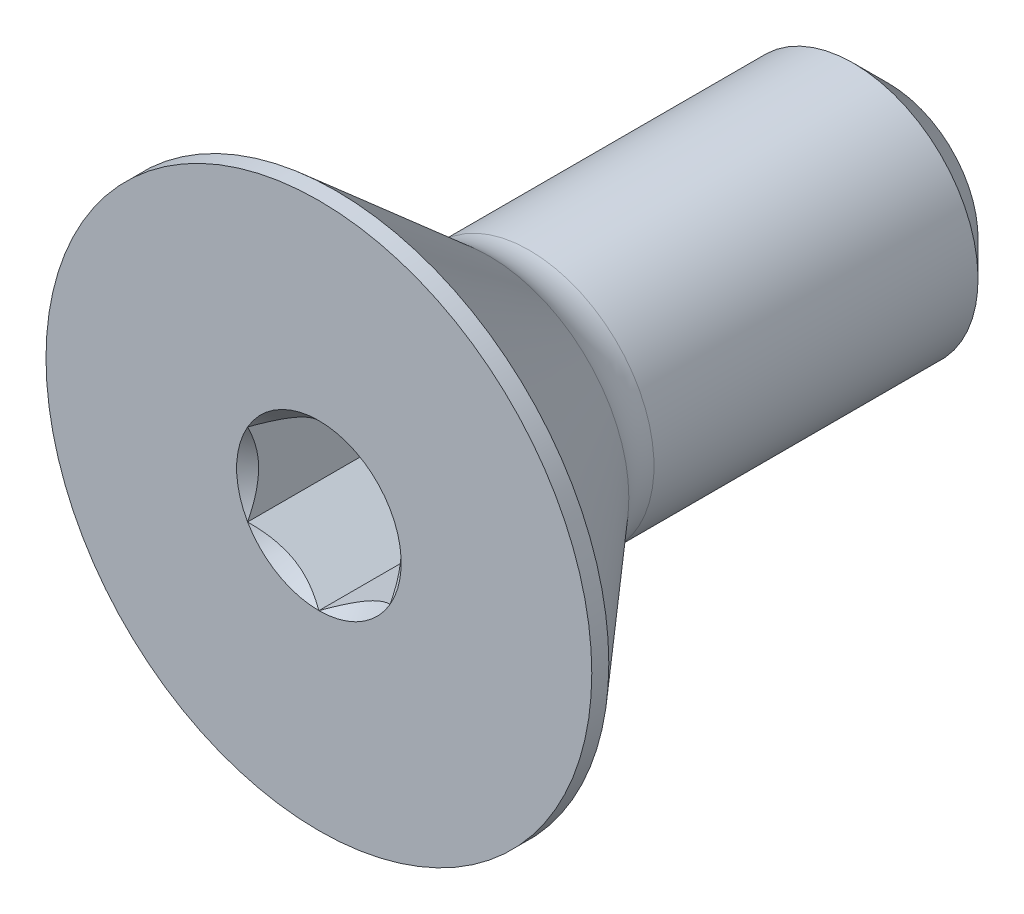
ISO-10303-21;
HEADER;
FILE_DESCRIPTION(('STEP AP214'),'2;1');
FILE_NAME('part.step','',(''),(''),'','','');
FILE_SCHEMA(('AUTOMOTIVE_DESIGN { 1 0 10303 214 1 1 1 1 }'));
ENDSEC;
DATA;
#1=APPLICATION_CONTEXT('core data for automotive mechanical design processes');
#2=APPLICATION_PROTOCOL_DEFINITION('international standard','automotive_design',2000,#1);
#3=PRODUCT_CONTEXT('',#1,'mechanical');
#4=PRODUCT('Part','Part','',(#3));
#5=PRODUCT_RELATED_PRODUCT_CATEGORY('part','',(#4));
#6=PRODUCT_DEFINITION_FORMATION('','',#4);
#7=PRODUCT_DEFINITION_CONTEXT('part definition',#1,'design');
#8=PRODUCT_DEFINITION('design','',#6,#7);
#9=PRODUCT_DEFINITION_SHAPE('','',#8);
#10=(LENGTH_UNIT() NAMED_UNIT(*) SI_UNIT(.MILLI.,.METRE.));
#11=(NAMED_UNIT(*) PLANE_ANGLE_UNIT() SI_UNIT($,.RADIAN.));
#12=(NAMED_UNIT(*) SI_UNIT($,.STERADIAN.) SOLID_ANGLE_UNIT());
#13=UNCERTAINTY_MEASURE_WITH_UNIT(LENGTH_MEASURE(1.E-05),#10,'distance_accuracy_value','');
#14=(GEOMETRIC_REPRESENTATION_CONTEXT(3) GLOBAL_UNCERTAINTY_ASSIGNED_CONTEXT((#13)) GLOBAL_UNIT_ASSIGNED_CONTEXT((#10,
#11,#12)) REPRESENTATION_CONTEXT('',''));
#15=CARTESIAN_POINT('',(0.,0.,0.));
#16=DIRECTION('',(0.,0.,1.));
#17=DIRECTION('',(1.,0.,0.));
#18=AXIS2_PLACEMENT_3D('',#15,#16,#17);
#19=CARTESIAN_POINT('',(0.,0.,-9.525));
#20=DIRECTION('',(0.,0.,-1.));
#21=DIRECTION('',(0.,1.,0.));
#22=AXIS2_PLACEMENT_3D('',#19,#20,#21);
#23=CYLINDRICAL_SURFACE('',#22,2.0828);
#24=CARTESIAN_POINT('',(0.,0.,-8.92968749999999));
#25=DIRECTION('',(0.,0.,-1.));
#26=DIRECTION('',(0.,1.,0.));
#27=AXIS2_PLACEMENT_3D('',#24,#25,#26);
#28=CIRCLE('',#27,2.0828);
#29=CARTESIAN_POINT('',(0.,2.0828,-8.92968749999999));
#30=VERTEX_POINT('',#29);
#31=EDGE_CURVE('E48',#30,#30,#28,.F.);
#32=ORIENTED_EDGE('',*,*,#31,.T.);
#33=EDGE_LOOP('',(#32));
#34=FACE_BOUND('',#33,.T.);
#35=CARTESIAN_POINT('',(0.,0.,-3.5157228625789));
#36=DIRECTION('',(0.,0.,1.));
#37=DIRECTION('',(0.,-1.,0.));
#38=AXIS2_PLACEMENT_3D('',#35,#36,#37);
#39=CIRCLE('',#38,2.08280000000001);
#40=CARTESIAN_POINT('',(0.,-2.08280000000001,-3.5157228625789));
#41=VERTEX_POINT('',#40);
#42=EDGE_CURVE('E175',#41,#41,#39,.T.);
#43=ORIENTED_EDGE('',*,*,#42,.F.);
#44=EDGE_LOOP('',(#43));
#45=FACE_BOUND('',#44,.T.);
#46=ADVANCED_FACE('F35',(#34,#45),#23,.T.);
#47=CARTESIAN_POINT('',(0.,-2.0828,-9.525));
#48=DIRECTION('',(0.,0.,-1.));
#49=DIRECTION('',(0.,1.,0.));
#50=AXIS2_PLACEMENT_3D('',#47,#48,#49);
#51=PLANE('',#50);
#52=CARTESIAN_POINT('',(0.,0.,-9.525));
#53=DIRECTION('',(0.,0.,-1.));
#54=DIRECTION('',(0.,1.,0.));
#55=AXIS2_PLACEMENT_3D('',#52,#53,#54);
#56=CIRCLE('',#55,1.4874875);
#57=CARTESIAN_POINT('',(0.,1.48748749999999,-9.525));
#58=VERTEX_POINT('',#57);
#59=EDGE_CURVE('E178',#58,#58,#56,.T.);
#60=ORIENTED_EDGE('',*,*,#59,.T.);
#61=EDGE_LOOP('',(#60));
#62=FACE_BOUND('',#61,.T.);
#63=ADVANCED_FACE('F188',(#62),#51,.T.);
#64=CARTESIAN_POINT('',(0.,0.,-9.525));
#65=DIRECTION('',(0.,0.,1.));
#66=DIRECTION('',(0.,-1.,0.));
#67=AXIS2_PLACEMENT_3D('',#64,#65,#66);
#68=CONICAL_SURFACE('',#67,1.4874875,0.785398163397446);
#69=ORIENTED_EDGE('',*,*,#31,.F.);
#70=EDGE_LOOP('',(#69));
#71=FACE_BOUND('',#70,.T.);
#72=ORIENTED_EDGE('',*,*,#59,.F.);
#73=EDGE_LOOP('',(#72));
#74=FACE_BOUND('',#73,.T.);
#75=ADVANCED_FACE('F37',(#71,#74),#68,.T.);
#76=CARTESIAN_POINT('',(0.,0.,-3.5157228625789));
#77=DIRECTION('',(0.,0.,1.));
#78=DIRECTION('',(0.,-1.,0.));
#79=AXIS2_PLACEMENT_3D('',#76,#77,#78);
#80=TOROIDAL_SURFACE('',#79,3.1054562442274,1.02265624422739);
#81=CARTESIAN_POINT('',(0.,0.,-2.8448));
#82=DIRECTION('',(0.,0.,1.));
#83=DIRECTION('',(0.,-1.,0.));
#84=AXIS2_PLACEMENT_3D('',#81,#82,#83);
#85=CIRCLE('',#84,2.33364777943435);
#86=CARTESIAN_POINT('',(0.,-2.33364777943435,-2.8448));
#87=VERTEX_POINT('',#86);
#88=EDGE_CURVE('E172',#87,#87,#85,.T.);
#89=ORIENTED_EDGE('',*,*,#88,.F.);
#90=EDGE_LOOP('',(#89));
#91=FACE_BOUND('',#90,.T.);
#92=ORIENTED_EDGE('',*,*,#42,.T.);
#93=EDGE_LOOP('',(#92));
#94=FACE_BOUND('',#93,.T.);
#95=ADVANCED_FACE('F187',(#91,#94),#80,.F.);
#96=CARTESIAN_POINT('',(0.,0.,-2.8448));
#97=DIRECTION('',(0.,0.,1.));
#98=DIRECTION('',(0.,-1.,0.));
#99=AXIS2_PLACEMENT_3D('',#96,#97,#98);
#100=CONICAL_SURFACE('',#99,2.33364777943435,0.715584993317676);
#101=CARTESIAN_POINT('',(0.,0.,-0.284479999999997));
#102=DIRECTION('',(0.,0.,1.));
#103=DIRECTION('',(0.,-1.,0.));
#104=AXIS2_PLACEMENT_3D('',#101,#102,#103);
#105=CIRCLE('',#104,4.5593);
#106=CARTESIAN_POINT('',(0.,-4.5593,-0.284479999999994));
#107=VERTEX_POINT('',#106);
#108=EDGE_CURVE('E169',#107,#107,#105,.T.);
#109=ORIENTED_EDGE('',*,*,#108,.F.);
#110=EDGE_LOOP('',(#109));
#111=FACE_BOUND('',#110,.T.);
#112=ORIENTED_EDGE('',*,*,#88,.T.);
#113=EDGE_LOOP('',(#112));
#114=FACE_BOUND('',#113,.T.);
#115=ADVANCED_FACE('F202',(#111,#114),#100,.T.);
#116=CARTESIAN_POINT('',(0.,0.,0.));
#117=DIRECTION('',(0.,0.,1.));
#118=DIRECTION('',(0.,-1.,0.));
#119=AXIS2_PLACEMENT_3D('',#116,#117,#118);
#120=CYLINDRICAL_SURFACE('',#119,4.5593);
#121=CARTESIAN_POINT('',(0.,0.,0.));
#122=DIRECTION('',(0.,0.,1.));
#123=DIRECTION('',(0.,-1.,0.));
#124=AXIS2_PLACEMENT_3D('',#121,#122,#123);
#125=CIRCLE('',#124,4.5593);
#126=CARTESIAN_POINT('',(0.,-4.5593,0.));
#127=VERTEX_POINT('',#126);
#128=EDGE_CURVE('E166',#127,#127,#125,.T.);
#129=ORIENTED_EDGE('',*,*,#128,.F.);
#130=EDGE_LOOP('',(#129));
#131=FACE_BOUND('',#130,.T.);
#132=ORIENTED_EDGE('',*,*,#108,.T.);
#133=EDGE_LOOP('',(#132));
#134=FACE_BOUND('',#133,.T.);
#135=ADVANCED_FACE('F198',(#131,#134),#120,.T.);
#136=CARTESIAN_POINT('',(0.,-2.08280000000001,0.));
#137=DIRECTION('',(0.,0.,1.));
#138=DIRECTION('',(0.,-1.,0.));
#139=AXIS2_PLACEMENT_3D('',#136,#137,#138);
#140=PLANE('',#139);
#141=CARTESIAN_POINT('',(0.,0.,0.));
#142=DIRECTION('',(0.,0.,1.));
#143=DIRECTION('',(1.,0.,0.));
#144=AXIS2_PLACEMENT_3D('',#141,#142,#143);
#145=CIRCLE('',#144,1.3748153285078);
#146=CARTESIAN_POINT('',(0.,-1.3748153285078,0.));
#147=VERTEX_POINT('',#146);
#148=CARTESIAN_POINT('',(1.190625,-0.687407664253901,0.));
#149=VERTEX_POINT('',#148);
#150=EDGE_CURVE('E94',#147,#149,#145,.T.);
#151=ORIENTED_EDGE('',*,*,#150,.F.);
#152=CARTESIAN_POINT('',(-1.190625,-0.687407664253898,0.));
#153=VERTEX_POINT('',#152);
#154=EDGE_CURVE('E54',#153,#147,#145,.T.);
#155=ORIENTED_EDGE('',*,*,#154,.F.);
#156=CARTESIAN_POINT('',(-1.190625,0.6874076642539,0.));
#157=VERTEX_POINT('',#156);
#158=EDGE_CURVE('E136',#157,#153,#145,.T.);
#159=ORIENTED_EDGE('',*,*,#158,.F.);
#160=CARTESIAN_POINT('',(0.,1.3748153285078,0.));
#161=VERTEX_POINT('',#160);
#162=EDGE_CURVE('E61',#161,#157,#145,.T.);
#163=ORIENTED_EDGE('',*,*,#162,.F.);
#164=CARTESIAN_POINT('',(1.190625,0.6874076642539,0.));
#165=VERTEX_POINT('',#164);
#166=EDGE_CURVE('E130',#165,#161,#145,.T.);
#167=ORIENTED_EDGE('',*,*,#166,.F.);
#168=EDGE_CURVE('E102',#149,#165,#145,.T.);
#169=ORIENTED_EDGE('',*,*,#168,.F.);
#170=EDGE_LOOP('',(#151,#155,#159,#163,#167,#169));
#171=FACE_BOUND('',#170,.T.);
#172=ORIENTED_EDGE('',*,*,#128,.T.);
#173=EDGE_LOOP('',(#172));
#174=FACE_BOUND('',#173,.T.);
#175=ADVANCED_FACE('F128',(#171,#174),#140,.T.);
#176=CARTESIAN_POINT('',(0.,0.,0.));
#177=DIRECTION('',(0.,0.,1.));
#178=DIRECTION('',(1.,0.,0.));
#179=AXIS2_PLACEMENT_3D('',#176,#177,#178);
#180=CONICAL_SURFACE('',#179,1.3748153285078,0.78539816339745);
#181=ORIENTED_EDGE('',*,*,#168,.T.);
#182=CARTESIAN_POINT('',(1.190625,-1.37097145294693,0.44099044728994));
#183=CARTESIAN_POINT('',(1.190625,-1.3375892063789,0.415789988807825));
#184=CARTESIAN_POINT('',(1.190625,-1.30402095496658,0.390836620237449));
#185=CARTESIAN_POINT('',(1.190625,-1.23643692297761,0.341526087177203));
#186=CARTESIAN_POINT('',(1.190625,-1.20242103219112,0.317169073899368));
#187=CARTESIAN_POINT('',(1.190625,-1.09909081482554,0.244798208989213));
#188=CARTESIAN_POINT('',(1.190625,-1.02900143506767,0.197872622595561));
#189=CARTESIAN_POINT('',(1.190625,-0.882026737424228,0.105752103325632));
#190=CARTESIAN_POINT('',(1.190625,-0.80498186601998,0.0608088372420599));
#191=CARTESIAN_POINT('',(1.190625,-0.647043893307964,-0.0214019754931322));
#192=CARTESIAN_POINT('',(1.190625,-0.56616494370292,-0.0586953982678785));
#193=CARTESIAN_POINT('',(1.190625,-0.444764933868856,-0.104320444436903));
#194=CARTESIAN_POINT('',(1.190625,-0.406041211486713,-0.117415160978516));
#195=CARTESIAN_POINT('',(1.190625,-0.327658904711933,-0.140495724103359));
#196=CARTESIAN_POINT('',(1.190625,-0.288000256118252,-0.150481356514043));
#197=CARTESIAN_POINT('',(1.190625,-0.208647693212097,-0.166658770934748));
#198=CARTESIAN_POINT('',(1.190625,-0.168967240621961,-0.172915554151022));
#199=CARTESIAN_POINT('',(1.190625,-0.0891819742965333,-0.181513111581486));
#200=CARTESIAN_POINT('',(1.190625,-0.0490772347013124,-0.183854558950103));
#201=CARTESIAN_POINT('',(1.190625,0.0297075773931764,-0.184447755932347));
#202=CARTESIAN_POINT('',(1.190625,0.0683866068288086,-0.182844646203951));
#203=CARTESIAN_POINT('',(1.190625,0.14541687663315,-0.175956972255489));
#204=CARTESIAN_POINT('',(1.190625,0.183768052740678,-0.170671702331516));
#205=CARTESIAN_POINT('',(1.190625,0.260508634904943,-0.156618587767133));
#206=CARTESIAN_POINT('',(1.190625,0.298887052039132,-0.147791637394191));
#207=CARTESIAN_POINT('',(1.190625,0.374805334250663,-0.127124290019378));
#208=CARTESIAN_POINT('',(1.190625,0.412345269207093,-0.115284145164062));
#209=CARTESIAN_POINT('',(1.190625,0.530535580908838,-0.0735526663328075));
#210=CARTESIAN_POINT('',(1.190625,0.609503725744446,-0.0389086030856534));
#211=CARTESIAN_POINT('',(1.190625,0.763730269113465,0.0381182519748624));
#212=CARTESIAN_POINT('',(1.190625,0.838974064674604,0.0805288466686649));
#213=CARTESIAN_POINT('',(1.190625,0.982775796189616,0.168025645024958));
#214=CARTESIAN_POINT('',(1.190625,1.05148016607044,0.212874162055225));
#215=CARTESIAN_POINT('',(1.190625,1.15270222256253,0.282205329922605));
#216=CARTESIAN_POINT('',(1.190625,1.18600604145834,0.305560176337172));
#217=CARTESIAN_POINT('',(1.190625,1.25215860362231,0.352887569019308));
#218=CARTESIAN_POINT('',(1.190625,1.28500746868278,0.376859944858281));
#219=CARTESIAN_POINT('',(1.190625,1.31766689427973,0.401088366771254));
#220=B_SPLINE_CURVE_WITH_KNOTS('',3,(#182,#183,#184,#185,#186,#187,#188,#189,#190,#191,#192,
#193,#194,#195,#196,#197,#198,#199,#200,#201,#202,#203,#204,#205,#206,#207,#208,#209,#210,#211,
#212,#213,#214,#215,#216,#217,#218,#219),.UNSPECIFIED.,.F.,.F.,(4,2,2,2,2,2,2,2,2,2,2,2,2,2,2,2,
2,2,4),(0.,0.125475644763329,0.250982782413967,0.503912518769173,0.771279184643224,
1.03772598255657,1.16025581644629,1.28279408906665,1.40312855503246,1.5234423300503,
1.63939577664876,1.75537145240477,1.87336894094838,1.99135655861152,2.24929724983448,
2.50818004711563,2.75419821472196,2.87622362118596,2.99821570388961),.UNSPECIFIED.);
#221=EDGE_CURVE('E11',#149,#165,#220,.T.);
#222=ORIENTED_EDGE('',*,*,#221,.F.);
#223=EDGE_LOOP('',(#181,#222));
#224=FACE_BOUND('',#223,.T.);
#225=ADVANCED_FACE('F106',(#224),#180,.F.);
#226=ORIENTED_EDGE('',*,*,#166,.T.);
#227=CARTESIAN_POINT('',(1.190825,0.687292194200061,0.000115484600023907));
#228=CARTESIAN_POINT('',(1.14989058041014,0.710925692369386,-0.0235012357857367));
#229=CARTESIAN_POINT('',(1.10827161169803,0.734954415158721,-0.0457312182768792));
#230=CARTESIAN_POINT('',(1.02340555632637,0.78395185507261,-0.0864343373725629));
#231=CARTESIAN_POINT('',(0.980150392709039,0.808925235430916,-0.104884817352448));
#232=CARTESIAN_POINT('',(0.892928352542576,0.859282903800292,-0.136491161995679));
#233=CARTESIAN_POINT('',(0.848983705042075,0.884654357864149,-0.149726495756683));
#234=CARTESIAN_POINT('',(0.760126625836307,0.935956016463003,-0.170118548424605));
#235=CARTESIAN_POINT('',(0.715216911165245,0.96188465231757,-0.177290497104007));
#236=CARTESIAN_POINT('',(0.637820872343022,1.00656927616579,-0.183761461351143));
#237=CARTESIAN_POINT('',(0.605434587484354,1.025267506447,-0.18471967985321));
#238=CARTESIAN_POINT('',(0.540718926682231,1.06263111063189,-0.183107350927916));
#239=CARTESIAN_POINT('',(0.508389564872728,1.08129647637533,-0.180536024820421));
#240=CARTESIAN_POINT('',(0.444042843928516,1.11844707303394,-0.172013246006379));
#241=CARTESIAN_POINT('',(0.412025803663232,1.13693211984976,-0.166058645247436));
#242=CARTESIAN_POINT('',(0.348526236603543,1.17359361198509,-0.1510900359288));
#243=CARTESIAN_POINT('',(0.317043945355836,1.19176992131166,-0.142074714087946));
#244=CARTESIAN_POINT('',(0.236410161427874,1.23832385816825,-0.115317704161983));
#245=CARTESIAN_POINT('',(0.187767164732342,1.26640790540461,-0.0955631855639916));
#246=CARTESIAN_POINT('',(0.0923855836478815,1.32147648691945,-0.0510632310423198));
#247=CARTESIAN_POINT('',(0.0456413824128448,1.34846426408555,-0.0263340352838412));
#248=CARTESIAN_POINT('',(-0.000199999999999753,1.37493079856163,0.000115484600024262));
#249=B_SPLINE_CURVE_WITH_KNOTS('',3,(#227,#228,#229,#230,#231,#232,#233,#234,#235,#236,#237,
#238,#239,#240,#241,#242,#243,#244,#245,#246,#247,#248),.UNSPECIFIED.,.F.,.F.,(4,2,2,2,2,2,2,2,
2,2,4),(0.,0.15862567293412,0.318176079843271,0.475191357500655,0.631811068630748,
0.743878551794717,0.855970763007028,0.968167444423241,1.08041232768376,1.25873351645467,
1.43648174479847),.UNSPECIFIED.);
#250=EDGE_CURVE('E132',#165,#161,#249,.T.);
#251=ORIENTED_EDGE('',*,*,#250,.F.);
#252=EDGE_LOOP('',(#226,#251));
#253=FACE_BOUND('',#252,.T.);
#254=ADVANCED_FACE('F278',(#253),#180,.F.);
#255=ORIENTED_EDGE('',*,*,#162,.T.);
#256=CARTESIAN_POINT('',(0.000200000000000185,1.37493079856163,0.000115484600024211));
#257=CARTESIAN_POINT('',(-0.040734419589856,1.35129730039231,-0.0235012357857364));
#258=CARTESIAN_POINT('',(-0.0823533883019736,1.32726857760297,-0.045731218276879));
#259=CARTESIAN_POINT('',(-0.167219443673632,1.27827113768909,-0.0864343373725627));
#260=CARTESIAN_POINT('',(-0.21047460729096,1.25329775733078,-0.104884817352448));
#261=CARTESIAN_POINT('',(-0.297696647457424,1.2029400889614,-0.136491161995679));
#262=CARTESIAN_POINT('',(-0.341641294957925,1.17756863489755,-0.149726495756683));
#263=CARTESIAN_POINT('',(-0.430498374163693,1.12626697629869,-0.170118548424605));
#264=CARTESIAN_POINT('',(-0.475408088834755,1.10033834044413,-0.177290497104008));
#265=CARTESIAN_POINT('',(-0.552804127656978,1.0556537165959,-0.183761461351144));
#266=CARTESIAN_POINT('',(-0.585190412515646,1.0369554863147,-0.18471967985321));
#267=CARTESIAN_POINT('',(-0.64990607331777,0.99959188212981,-0.183107350927916));
#268=CARTESIAN_POINT('',(-0.682235435127273,0.980926516386365,-0.180536024820421));
#269=CARTESIAN_POINT('',(-0.746582156071485,0.943775919727754,-0.172013246006379));
#270=CARTESIAN_POINT('',(-0.778599196336768,0.925290872911938,-0.166058645247436));
#271=CARTESIAN_POINT('',(-0.842098763396457,0.888629380776601,-0.1510900359288));
#272=CARTESIAN_POINT('',(-0.873581054644164,0.870453071450031,-0.142074714087946));
#273=CARTESIAN_POINT('',(-0.954214838572127,0.823899134593444,-0.115317704161983));
#274=CARTESIAN_POINT('',(-1.00285783526766,0.795815087357089,-0.0955631855639917));
#275=CARTESIAN_POINT('',(-1.09823941635212,0.740746505842244,-0.0510632310423198));
#276=CARTESIAN_POINT('',(-1.14498361758716,0.713758728676141,-0.026334035283841));
#277=CARTESIAN_POINT('',(-1.190825,0.687292194200061,0.000115484600024368));
#278=B_SPLINE_CURVE_WITH_KNOTS('',3,(#256,#257,#258,#259,#260,#261,#262,#263,#264,#265,#266,
#267,#268,#269,#270,#271,#272,#273,#274,#275,#276,#277),.UNSPECIFIED.,.F.,.F.,(4,2,2,2,2,2,2,2,
2,2,4),(0.,0.15862567293412,0.318176079843271,0.475191357500655,0.631811068630748,
0.743878551794718,0.855970763007029,0.968167444423242,1.08041232768377,1.25873351645467,
1.43648174479847),.UNSPECIFIED.);
#279=EDGE_CURVE('E135',#161,#157,#278,.T.);
#280=ORIENTED_EDGE('',*,*,#279,.F.);
#281=EDGE_LOOP('',(#255,#280));
#282=FACE_BOUND('',#281,.T.);
#283=ADVANCED_FACE('F274',(#282),#180,.F.);
#284=ORIENTED_EDGE('',*,*,#158,.T.);
#285=CARTESIAN_POINT('',(-1.190625,-1.37097145294693,0.44099044728994));
#286=CARTESIAN_POINT('',(-1.190625,-1.3375892063789,0.415789988807825));
#287=CARTESIAN_POINT('',(-1.190625,-1.30402095496658,0.390836620237449));
#288=CARTESIAN_POINT('',(-1.190625,-1.23643692297761,0.341526087177203));
#289=CARTESIAN_POINT('',(-1.190625,-1.20242103219112,0.317169073899368));
#290=CARTESIAN_POINT('',(-1.190625,-1.09909081482554,0.244798208989213));
#291=CARTESIAN_POINT('',(-1.190625,-1.02900143506767,0.197872622595561));
#292=CARTESIAN_POINT('',(-1.190625,-0.882026737424227,0.105752103325632));
#293=CARTESIAN_POINT('',(-1.190625,-0.804981866019979,0.0608088372420601));
#294=CARTESIAN_POINT('',(-1.190625,-0.647043893307963,-0.021401975493132));
#295=CARTESIAN_POINT('',(-1.190625,-0.566164943702919,-0.0586953982678783));
#296=CARTESIAN_POINT('',(-1.190625,-0.444764933868855,-0.104320444436902));
#297=CARTESIAN_POINT('',(-1.190625,-0.406041211486712,-0.117415160978515));
#298=CARTESIAN_POINT('',(-1.190625,-0.327658904711932,-0.140495724103359));
#299=CARTESIAN_POINT('',(-1.190625,-0.288000256118251,-0.150481356514043));
#300=CARTESIAN_POINT('',(-1.190625,-0.208647693212096,-0.166658770934748));
#301=CARTESIAN_POINT('',(-1.190625,-0.168967240621961,-0.172915554151022));
#302=CARTESIAN_POINT('',(-1.190625,-0.0891819742965325,-0.181513111581485));
#303=CARTESIAN_POINT('',(-1.190625,-0.0490772347013118,-0.183854558950103));
#304=CARTESIAN_POINT('',(-1.190625,0.0297075773931769,-0.184447755932347));
#305=CARTESIAN_POINT('',(-1.190625,0.068386606828809,-0.182844646203951));
#306=CARTESIAN_POINT('',(-1.190625,0.145416876633151,-0.175956972255488));
#307=CARTESIAN_POINT('',(-1.190625,0.183768052740679,-0.170671702331516));
#308=CARTESIAN_POINT('',(-1.190625,0.260508634904944,-0.156618587767133));
#309=CARTESIAN_POINT('',(-1.190625,0.298887052039132,-0.14779163739419));
#310=CARTESIAN_POINT('',(-1.190625,0.374805334250663,-0.127124290019377));
#311=CARTESIAN_POINT('',(-1.190625,0.412345269207094,-0.115284145164061));
#312=CARTESIAN_POINT('',(-1.190625,0.530535580908839,-0.0735526663328067));
#313=CARTESIAN_POINT('',(-1.190625,0.609503725744447,-0.0389086030856525));
#314=CARTESIAN_POINT('',(-1.190625,0.763730269113466,0.0381182519748635));
#315=CARTESIAN_POINT('',(-1.190625,0.838974064674605,0.080528846668666));
#316=CARTESIAN_POINT('',(-1.190625,0.982775796189618,0.168025645024959));
#317=CARTESIAN_POINT('',(-1.190625,1.05148016607044,0.212874162055226));
#318=CARTESIAN_POINT('',(-1.190625,1.15270222256253,0.282205329922607));
#319=CARTESIAN_POINT('',(-1.190625,1.18600604145834,0.305560176337173));
#320=CARTESIAN_POINT('',(-1.190625,1.25215860362232,0.35288756901931));
#321=CARTESIAN_POINT('',(-1.190625,1.28500746868279,0.376859944858282));
#322=CARTESIAN_POINT('',(-1.190625,1.31766689427973,0.401088366771256));
#323=B_SPLINE_CURVE_WITH_KNOTS('',3,(#285,#286,#287,#288,#289,#290,#291,#292,#293,#294,#295,
#296,#297,#298,#299,#300,#301,#302,#303,#304,#305,#306,#307,#308,#309,#310,#311,#312,#313,#314,
#315,#316,#317,#318,#319,#320,#321,#322),.UNSPECIFIED.,.F.,.F.,(4,2,2,2,2,2,2,2,2,2,2,2,2,2,2,2,
2,2,4),(0.,0.125475644763329,0.250982782413966,0.503912518769173,0.771279184643224,
1.03772598255657,1.16025581644629,1.28279408906665,1.40312855503246,1.5234423300503,
1.63939577664876,1.75537145240477,1.87336894094838,1.99135655861152,2.24929724983449,
2.50818004711563,2.75419821472196,2.87622362118596,2.99821570388961),.UNSPECIFIED.);
#324=EDGE_CURVE('E142',#157,#153,#323,.F.);
#325=ORIENTED_EDGE('',*,*,#324,.F.);
#326=EDGE_LOOP('',(#284,#325));
#327=FACE_BOUND('',#326,.T.);
#328=ADVANCED_FACE('F140',(#327),#180,.F.);
#329=ORIENTED_EDGE('',*,*,#154,.T.);
#330=CARTESIAN_POINT('',(-1.190825,-0.68729219420006,0.000115484600023689));
#331=CARTESIAN_POINT('',(-1.14989058041014,-0.710925692369384,-0.0235012357857369));
#332=CARTESIAN_POINT('',(-1.10827161169803,-0.73495441515872,-0.0457312182768796));
#333=CARTESIAN_POINT('',(-1.02340555632637,-0.783951855072609,-0.0864343373725634));
#334=CARTESIAN_POINT('',(-0.98015039270904,-0.808925235430915,-0.104884817352449));
#335=CARTESIAN_POINT('',(-0.892928352542576,-0.859282903800291,-0.13649116199568));
#336=CARTESIAN_POINT('',(-0.848983705042075,-0.884654357864148,-0.149726495756684));
#337=CARTESIAN_POINT('',(-0.760126625836306,-0.935956016463002,-0.170118548424606));
#338=CARTESIAN_POINT('',(-0.715216911165245,-0.961884652317569,-0.177290497104008));
#339=CARTESIAN_POINT('',(-0.637820872343022,-1.00656927616579,-0.183761461351144));
#340=CARTESIAN_POINT('',(-0.605434587484354,-1.02526750644699,-0.184719679853211));
#341=CARTESIAN_POINT('',(-0.540718926682231,-1.06263111063188,-0.183107350927917));
#342=CARTESIAN_POINT('',(-0.508389564872728,-1.08129647637533,-0.180536024820421));
#343=CARTESIAN_POINT('',(-0.444042843928516,-1.11844707303394,-0.172013246006379));
#344=CARTESIAN_POINT('',(-0.412025803663232,-1.13693211984976,-0.166058645247437));
#345=CARTESIAN_POINT('',(-0.348526236603543,-1.17359361198509,-0.151090035928801));
#346=CARTESIAN_POINT('',(-0.317043945355836,-1.19176992131166,-0.142074714087946));
#347=CARTESIAN_POINT('',(-0.236410161427874,-1.23832385816825,-0.115317704161984));
#348=CARTESIAN_POINT('',(-0.187767164732342,-1.26640790540461,-0.0955631855639923));
#349=CARTESIAN_POINT('',(-0.0923855836478813,-1.32147648691945,-0.0510632310423205));
#350=CARTESIAN_POINT('',(-0.0456413824128447,-1.34846426408555,-0.0263340352838419));
#351=CARTESIAN_POINT('',(0.000199999999999914,-1.37493079856163,0.000115484600023635));
#352=B_SPLINE_CURVE_WITH_KNOTS('',3,(#330,#331,#332,#333,#334,#335,#336,#337,#338,#339,#340,
#341,#342,#343,#344,#345,#346,#347,#348,#349,#350,#351),.UNSPECIFIED.,.F.,.F.,(4,2,2,2,2,2,2,2,
2,2,4),(0.,0.15862567293412,0.318176079843271,0.475191357500656,0.631811068630749,
0.743878551794718,0.855970763007029,0.968167444423242,1.08041232768377,1.25873351645467,
1.43648174479847),.UNSPECIFIED.);
#353=EDGE_CURVE('E118',#153,#147,#352,.T.);
#354=ORIENTED_EDGE('',*,*,#353,.F.);
#355=EDGE_LOOP('',(#329,#354));
#356=FACE_BOUND('',#355,.T.);
#357=ADVANCED_FACE('F229',(#356),#180,.F.);
#358=ORIENTED_EDGE('',*,*,#150,.T.);
#359=CARTESIAN_POINT('',(-0.000200000000000002,-1.37493079856163,0.00011548460002356));
#360=CARTESIAN_POINT('',(0.0407344195898563,-1.35129730039231,-0.0235012357857371));
#361=CARTESIAN_POINT('',(0.0823533883019738,-1.32726857760297,-0.0457312182768796));
#362=CARTESIAN_POINT('',(0.167219443673632,-1.27827113768909,-0.0864343373725633));
#363=CARTESIAN_POINT('',(0.21047460729096,-1.25329775733078,-0.104884817352449));
#364=CARTESIAN_POINT('',(0.297696647457424,-1.2029400889614,-0.136491161995679));
#365=CARTESIAN_POINT('',(0.341641294957925,-1.17756863489755,-0.149726495756684));
#366=CARTESIAN_POINT('',(0.430498374163693,-1.12626697629869,-0.170118548424606));
#367=CARTESIAN_POINT('',(0.475408088834754,-1.10033834044413,-0.177290497104008));
#368=CARTESIAN_POINT('',(0.552804127656978,-1.0556537165959,-0.183761461351144));
#369=CARTESIAN_POINT('',(0.585190412515646,-1.0369554863147,-0.184719679853211));
#370=CARTESIAN_POINT('',(0.64990607331777,-0.99959188212981,-0.183107350927916));
#371=CARTESIAN_POINT('',(0.682235435127272,-0.980926516386364,-0.180536024820421));
#372=CARTESIAN_POINT('',(0.746582156071484,-0.943775919727754,-0.172013246006379));
#373=CARTESIAN_POINT('',(0.778599196336768,-0.925290872911937,-0.166058645247436));
#374=CARTESIAN_POINT('',(0.842098763396457,-0.888629380776601,-0.1510900359288));
#375=CARTESIAN_POINT('',(0.873581054644164,-0.870453071450031,-0.142074714087946));
#376=CARTESIAN_POINT('',(0.954214838572126,-0.823899134593444,-0.115317704161984));
#377=CARTESIAN_POINT('',(1.00285783526766,-0.795815087357089,-0.0955631855639921));
#378=CARTESIAN_POINT('',(1.09823941635212,-0.740746505842244,-0.0510632310423204));
#379=CARTESIAN_POINT('',(1.14498361758715,-0.713758728676141,-0.0263340352838418));
#380=CARTESIAN_POINT('',(1.190825,-0.687292194200061,0.000115484600023613));
#381=B_SPLINE_CURVE_WITH_KNOTS('',3,(#359,#360,#361,#362,#363,#364,#365,#366,#367,#368,#369,
#370,#371,#372,#373,#374,#375,#376,#377,#378,#379,#380),.UNSPECIFIED.,.F.,.F.,(4,2,2,2,2,2,2,2,
2,2,4),(0.,0.15862567293412,0.318176079843271,0.475191357500655,0.631811068630748,
0.743878551794718,0.855970763007028,0.968167444423241,1.08041232768377,1.25873351645467,
1.43648174479847),.UNSPECIFIED.);
#382=EDGE_CURVE('E98',#147,#149,#381,.T.);
#383=ORIENTED_EDGE('',*,*,#382,.F.);
#384=EDGE_LOOP('',(#358,#383));
#385=FACE_BOUND('',#384,.T.);
#386=ADVANCED_FACE('F96',(#385),#180,.F.);
#387=CARTESIAN_POINT('',(1.190625,-0.687407664253899,-1.99136));
#388=DIRECTION('',(0.,0.,1.));
#389=DIRECTION('',(1.,0.,0.));
#390=AXIS2_PLACEMENT_3D('',#387,#388,#389);
#391=PLANE('',#390);
#392=DIRECTION('',(0.866025403784439,0.5,0.));
#393=VECTOR('',#392,1.);
#394=CARTESIAN_POINT('',(0.,-1.3748153285078,-1.99136));
#395=LINE('',#394,#393);
#396=CARTESIAN_POINT('',(0.,-1.3748153285078,-1.99136));
#397=VERTEX_POINT('',#396);
#398=CARTESIAN_POINT('',(1.190625,-0.687407664253899,-1.99136));
#399=VERTEX_POINT('',#398);
#400=EDGE_CURVE('E117',#397,#399,#395,.T.);
#401=ORIENTED_EDGE('',*,*,#400,.T.);
#402=DIRECTION('',(0.,1.,0.));
#403=VECTOR('',#402,1.);
#404=CARTESIAN_POINT('',(1.190625,-0.687407664253899,-1.99136));
#405=LINE('',#404,#403);
#406=CARTESIAN_POINT('',(1.190625,0.687407664253899,-1.99136));
#407=VERTEX_POINT('',#406);
#408=EDGE_CURVE('E122',#399,#407,#405,.T.);
#409=ORIENTED_EDGE('',*,*,#408,.T.);
#410=DIRECTION('',(-0.866025403784439,0.5,0.));
#411=VECTOR('',#410,1.);
#412=CARTESIAN_POINT('',(1.190625,0.687407664253899,-1.99136));
#413=LINE('',#412,#411);
#414=CARTESIAN_POINT('',(0.,1.3748153285078,-1.99136));
#415=VERTEX_POINT('',#414);
#416=EDGE_CURVE('E260',#407,#415,#413,.T.);
#417=ORIENTED_EDGE('',*,*,#416,.T.);
#418=DIRECTION('',(-0.866025403784439,-0.5,0.));
#419=VECTOR('',#418,1.);
#420=CARTESIAN_POINT('',(0.,1.3748153285078,-1.99136));
#421=LINE('',#420,#419);
#422=CARTESIAN_POINT('',(-1.190625,0.687407664253899,-1.99136));
#423=VERTEX_POINT('',#422);
#424=EDGE_CURVE('E262',#415,#423,#421,.T.);
#425=ORIENTED_EDGE('',*,*,#424,.T.);
#426=DIRECTION('',(0.,-1.,0.));
#427=VECTOR('',#426,1.);
#428=CARTESIAN_POINT('',(-1.190625,0.687407664253899,-1.99136));
#429=LINE('',#428,#427);
#430=CARTESIAN_POINT('',(-1.190625,-0.687407664253898,-1.99136));
#431=VERTEX_POINT('',#430);
#432=EDGE_CURVE('E157',#423,#431,#429,.T.);
#433=ORIENTED_EDGE('',*,*,#432,.T.);
#434=DIRECTION('',(0.866025403784439,-0.5,0.));
#435=VECTOR('',#434,1.);
#436=CARTESIAN_POINT('',(-1.190625,-0.687407664253898,-1.99136));
#437=LINE('',#436,#435);
#438=EDGE_CURVE('E125',#431,#397,#437,.T.);
#439=ORIENTED_EDGE('',*,*,#438,.T.);
#440=EDGE_LOOP('',(#401,#409,#417,#425,#433,#439));
#441=FACE_BOUND('',#440,.T.);
#442=ADVANCED_FACE('F228',(#441),#391,.T.);
#443=CARTESIAN_POINT('',(1.190625,-0.687407664253899,-1.99136));
#444=DIRECTION('',(1.,0.,0.));
#445=DIRECTION('',(0.,1.,0.));
#446=AXIS2_PLACEMENT_3D('',#443,#444,#445);
#447=PLANE('',#446);
#448=DIRECTION('',(0.,0.,1.));
#449=VECTOR('',#448,1.);
#450=CARTESIAN_POINT('',(1.190625,-0.687407664253899,-1.99136));
#451=LINE('',#450,#449);
#452=EDGE_CURVE('E114',#399,#149,#451,.T.);
#453=ORIENTED_EDGE('',*,*,#452,.T.);
#454=ORIENTED_EDGE('',*,*,#221,.T.);
#455=DIRECTION('',(0.,0.,1.));
#456=VECTOR('',#455,1.);
#457=CARTESIAN_POINT('',(1.190625,0.687407664253899,-1.99136));
#458=LINE('',#457,#456);
#459=EDGE_CURVE('E124',#407,#165,#458,.T.);
#460=ORIENTED_EDGE('',*,*,#459,.F.);
#461=ORIENTED_EDGE('',*,*,#408,.F.);
#462=EDGE_LOOP('',(#453,#454,#460,#461));
#463=FACE_BOUND('',#462,.T.);
#464=ADVANCED_FACE('F120',(#463),#447,.F.);
#465=CARTESIAN_POINT('',(1.190625,0.687407664253899,-1.99136));
#466=DIRECTION('',(0.5,0.866025403784439,0.));
#467=DIRECTION('',(-0.866025403784439,0.5,0.));
#468=AXIS2_PLACEMENT_3D('',#465,#466,#467);
#469=PLANE('',#468);
#470=ORIENTED_EDGE('',*,*,#459,.T.);
#471=ORIENTED_EDGE('',*,*,#250,.T.);
#472=DIRECTION('',(0.,0.,1.));
#473=VECTOR('',#472,1.);
#474=CARTESIAN_POINT('',(0.,1.3748153285078,-1.99136));
#475=LINE('',#474,#473);
#476=EDGE_CURVE('E153',#415,#161,#475,.T.);
#477=ORIENTED_EDGE('',*,*,#476,.F.);
#478=ORIENTED_EDGE('',*,*,#416,.F.);
#479=EDGE_LOOP('',(#470,#471,#477,#478));
#480=FACE_BOUND('',#479,.T.);
#481=ADVANCED_FACE('F251',(#480),#469,.F.);
#482=CARTESIAN_POINT('',(0.,1.3748153285078,-1.99136));
#483=DIRECTION('',(-0.5,0.866025403784439,0.));
#484=DIRECTION('',(-0.866025403784439,-0.5,0.));
#485=AXIS2_PLACEMENT_3D('',#482,#483,#484);
#486=PLANE('',#485);
#487=ORIENTED_EDGE('',*,*,#476,.T.);
#488=ORIENTED_EDGE('',*,*,#279,.T.);
#489=DIRECTION('',(0.,0.,1.));
#490=VECTOR('',#489,1.);
#491=CARTESIAN_POINT('',(-1.190625,0.687407664253899,-1.99136));
#492=LINE('',#491,#490);
#493=EDGE_CURVE('E151',#423,#157,#492,.T.);
#494=ORIENTED_EDGE('',*,*,#493,.F.);
#495=ORIENTED_EDGE('',*,*,#424,.F.);
#496=EDGE_LOOP('',(#487,#488,#494,#495));
#497=FACE_BOUND('',#496,.T.);
#498=ADVANCED_FACE('F149',(#497),#486,.F.);
#499=CARTESIAN_POINT('',(-1.190625,0.687407664253899,-1.99136));
#500=DIRECTION('',(-1.,0.,0.));
#501=DIRECTION('',(0.,0.,1.));
#502=AXIS2_PLACEMENT_3D('',#499,#500,#501);
#503=PLANE('',#502);
#504=ORIENTED_EDGE('',*,*,#493,.T.);
#505=ORIENTED_EDGE('',*,*,#324,.T.);
#506=DIRECTION('',(0.,0.,1.));
#507=VECTOR('',#506,1.);
#508=CARTESIAN_POINT('',(-1.190625,-0.687407664253898,-1.99136));
#509=LINE('',#508,#507);
#510=EDGE_CURVE('E159',#431,#153,#509,.T.);
#511=ORIENTED_EDGE('',*,*,#510,.F.);
#512=ORIENTED_EDGE('',*,*,#432,.F.);
#513=EDGE_LOOP('',(#504,#505,#511,#512));
#514=FACE_BOUND('',#513,.T.);
#515=ADVANCED_FACE('F155',(#514),#503,.F.);
#516=CARTESIAN_POINT('',(-1.190625,-0.687407664253898,-1.99136));
#517=DIRECTION('',(-0.5,-0.866025403784439,0.));
#518=DIRECTION('',(0.866025403784439,-0.5,0.));
#519=AXIS2_PLACEMENT_3D('',#516,#517,#518);
#520=PLANE('',#519);
#521=ORIENTED_EDGE('',*,*,#510,.T.);
#522=ORIENTED_EDGE('',*,*,#353,.T.);
#523=DIRECTION('',(0.,0.,1.));
#524=VECTOR('',#523,1.);
#525=CARTESIAN_POINT('',(0.,-1.3748153285078,-1.99136));
#526=LINE('',#525,#524);
#527=EDGE_CURVE('E116',#397,#147,#526,.T.);
#528=ORIENTED_EDGE('',*,*,#527,.F.);
#529=ORIENTED_EDGE('',*,*,#438,.F.);
#530=EDGE_LOOP('',(#521,#522,#528,#529));
#531=FACE_BOUND('',#530,.T.);
#532=ADVANCED_FACE('F212',(#531),#520,.F.);
#533=CARTESIAN_POINT('',(0.,-1.3748153285078,-1.99136));
#534=DIRECTION('',(0.5,-0.866025403784439,0.));
#535=DIRECTION('',(0.866025403784439,0.5,0.));
#536=AXIS2_PLACEMENT_3D('',#533,#534,#535);
#537=PLANE('',#536);
#538=ORIENTED_EDGE('',*,*,#527,.T.);
#539=ORIENTED_EDGE('',*,*,#382,.T.);
#540=ORIENTED_EDGE('',*,*,#452,.F.);
#541=ORIENTED_EDGE('',*,*,#400,.F.);
#542=EDGE_LOOP('',(#538,#539,#540,#541));
#543=FACE_BOUND('',#542,.T.);
#544=ADVANCED_FACE('F112',(#543),#537,.F.);
#545=CLOSED_SHELL('',(#46,#63,#75,#95,#115,#135,#175,#225,#254,#283,#328,#357,#386,#442,#464,
#481,#498,#515,#532,#544));
#546=MANIFOLD_SOLID_BREP('B2',#545);
#547=ADVANCED_BREP_SHAPE_REPRESENTATION('',(#18,#546),#14);
#548=SHAPE_DEFINITION_REPRESENTATION(#9,#547);
ENDSEC;
END-ISO-10303-21;
